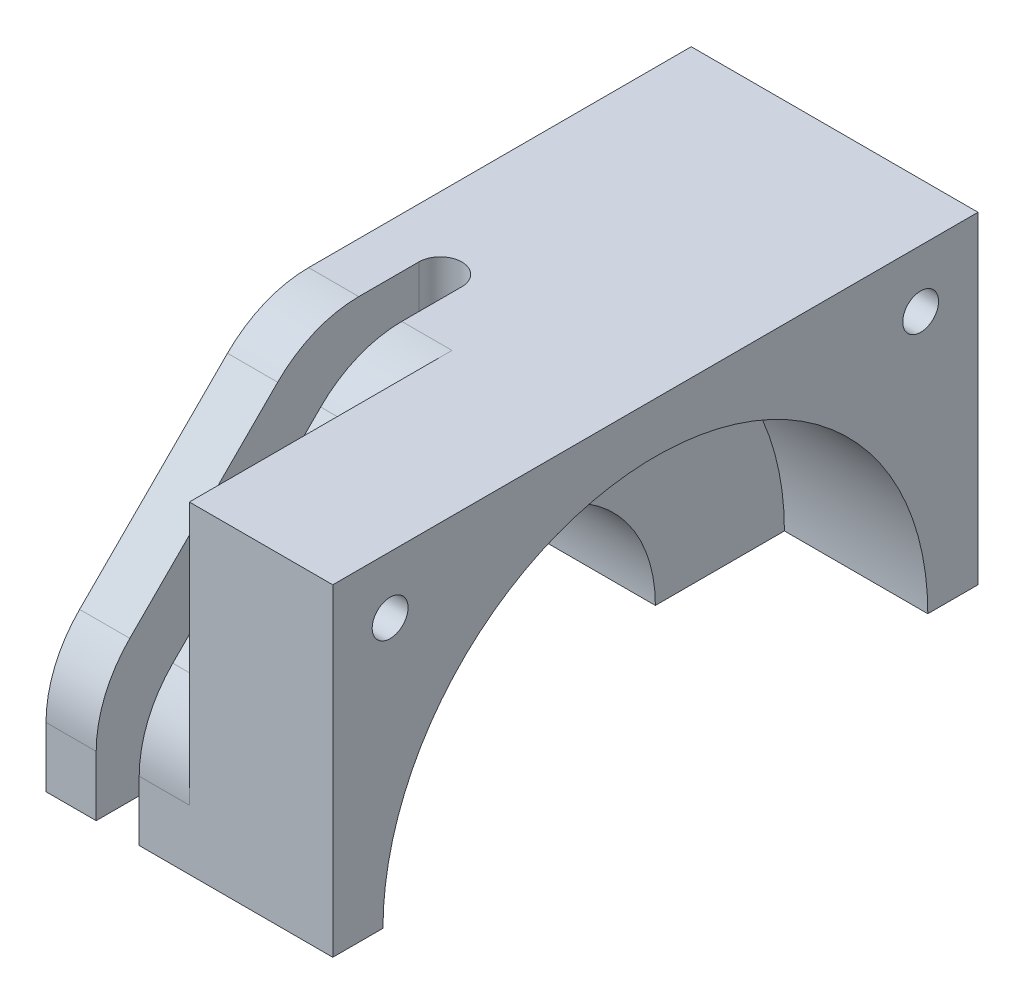
ISO-10303-21;
HEADER;
FILE_DESCRIPTION(('STEP AP214'),'2;1');
FILE_NAME('part.step','',(''),(''),'','','');
FILE_SCHEMA(('AUTOMOTIVE_DESIGN { 1 0 10303 214 1 1 1 1 }'));
ENDSEC;
DATA;
#1=APPLICATION_CONTEXT('core data for automotive mechanical design processes');
#2=APPLICATION_PROTOCOL_DEFINITION('international standard','automotive_design',2000,#1);
#3=PRODUCT_CONTEXT('',#1,'mechanical');
#4=PRODUCT('Part','Part','',(#3));
#5=PRODUCT_RELATED_PRODUCT_CATEGORY('part','',(#4));
#6=PRODUCT_DEFINITION_FORMATION('','',#4);
#7=PRODUCT_DEFINITION_CONTEXT('part definition',#1,'design');
#8=PRODUCT_DEFINITION('design','',#6,#7);
#9=PRODUCT_DEFINITION_SHAPE('','',#8);
#10=(LENGTH_UNIT() NAMED_UNIT(*) SI_UNIT(.MILLI.,.METRE.));
#11=(NAMED_UNIT(*) PLANE_ANGLE_UNIT() SI_UNIT($,.RADIAN.));
#12=(NAMED_UNIT(*) SI_UNIT($,.STERADIAN.) SOLID_ANGLE_UNIT());
#13=UNCERTAINTY_MEASURE_WITH_UNIT(LENGTH_MEASURE(1.E-05),#10,'distance_accuracy_value','');
#14=(GEOMETRIC_REPRESENTATION_CONTEXT(3) GLOBAL_UNCERTAINTY_ASSIGNED_CONTEXT((#13)) GLOBAL_UNIT_ASSIGNED_CONTEXT((#10,
#11,#12)) REPRESENTATION_CONTEXT('',''));
#15=CARTESIAN_POINT('',(0.,0.,0.));
#16=DIRECTION('',(0.,0.,1.));
#17=DIRECTION('',(1.,0.,0.));
#18=AXIS2_PLACEMENT_3D('',#15,#16,#17);
#19=CARTESIAN_POINT('',(27.7245829544828,0.,-34.06));
#20=DIRECTION('',(0.,-1.,0.));
#21=DIRECTION('',(0.,0.,-1.));
#22=AXIS2_PLACEMENT_3D('',#19,#20,#21);
#23=PLANE('',#22);
#24=DIRECTION('',(-1.,0.,0.));
#25=VECTOR('',#24,1.);
#26=CARTESIAN_POINT('',(-53.5619892583636,0.,-22.5));
#27=LINE('',#26,#25);
#28=CARTESIAN_POINT('',(56.05,0.,-22.5));
#29=VERTEX_POINT('',#28);
#30=CARTESIAN_POINT('',(36.05,0.,-22.5));
#31=VERTEX_POINT('',#30);
#32=EDGE_CURVE('E208',#29,#31,#27,.T.);
#33=ORIENTED_EDGE('',*,*,#32,.F.);
#34=DIRECTION('',(0.,0.,-1.));
#35=VECTOR('',#34,1.);
#36=CARTESIAN_POINT('',(56.05,0.,0.));
#37=LINE('',#36,#35);
#38=CARTESIAN_POINT('',(56.05,0.,-19.));
#39=VERTEX_POINT('',#38);
#40=EDGE_CURVE('E387',#39,#29,#37,.T.);
#41=ORIENTED_EDGE('',*,*,#40,.F.);
#42=DIRECTION('',(1.,0.,0.));
#43=VECTOR('',#42,1.);
#44=CARTESIAN_POINT('',(46.05,0.,-19.));
#45=LINE('',#44,#43);
#46=CARTESIAN_POINT('',(46.05,0.,-19.));
#47=VERTEX_POINT('',#46);
#48=EDGE_CURVE('E216',#39,#47,#45,.F.);
#49=ORIENTED_EDGE('',*,*,#48,.T.);
#50=DIRECTION('',(0.,0.,-1.));
#51=VECTOR('',#50,1.);
#52=CARTESIAN_POINT('',(46.05,0.,0.));
#53=LINE('',#52,#51);
#54=CARTESIAN_POINT('',(46.05,0.,-10.));
#55=VERTEX_POINT('',#54);
#56=EDGE_CURVE('E382',#55,#47,#53,.T.);
#57=ORIENTED_EDGE('',*,*,#56,.F.);
#58=DIRECTION('',(1.,0.,0.));
#59=VECTOR('',#58,1.);
#60=CARTESIAN_POINT('',(21.05,0.,-10.));
#61=LINE('',#60,#59);
#62=CARTESIAN_POINT('',(36.05,0.,-10.));
#63=VERTEX_POINT('',#62);
#64=EDGE_CURVE('E405',#55,#63,#61,.F.);
#65=ORIENTED_EDGE('',*,*,#64,.T.);
#66=DIRECTION('',(0.,0.,1.));
#67=VECTOR('',#66,1.);
#68=CARTESIAN_POINT('',(36.05,0.,0.));
#69=LINE('',#68,#67);
#70=EDGE_CURVE('E402',#31,#63,#69,.T.);
#71=ORIENTED_EDGE('',*,*,#70,.F.);
#72=EDGE_LOOP('',(#33,#41,#49,#57,#65,#71));
#73=FACE_BOUND('',#72,.T.);
#74=ADVANCED_FACE('F47',(#73),#23,.T.);
#75=CARTESIAN_POINT('',(36.05,0.,10.));
#76=VERTEX_POINT('',#75);
#77=CARTESIAN_POINT('',(36.05,0.,22.5));
#78=VERTEX_POINT('',#77);
#79=EDGE_CURVE('E401',#76,#78,#69,.T.);
#80=ORIENTED_EDGE('',*,*,#79,.F.);
#81=DIRECTION('',(1.,0.,0.));
#82=VECTOR('',#81,1.);
#83=CARTESIAN_POINT('',(21.05,0.,10.));
#84=LINE('',#83,#82);
#85=CARTESIAN_POINT('',(39.55,0.,10.));
#86=VERTEX_POINT('',#85);
#87=EDGE_CURVE('E213',#76,#86,#84,.T.);
#88=ORIENTED_EDGE('',*,*,#87,.T.);
#89=DIRECTION('',(0.,0.,1.));
#90=VECTOR('',#89,1.);
#91=CARTESIAN_POINT('',(39.55,0.,0.));
#92=LINE('',#91,#90);
#93=CARTESIAN_POINT('',(39.55,0.,22.5));
#94=VERTEX_POINT('',#93);
#95=EDGE_CURVE('E51',#86,#94,#92,.T.);
#96=ORIENTED_EDGE('',*,*,#95,.T.);
#97=DIRECTION('',(1.,0.,0.));
#98=VECTOR('',#97,1.);
#99=CARTESIAN_POINT('',(-53.5619892583636,0.,22.5));
#100=LINE('',#99,#98);
#101=EDGE_CURVE('E201',#78,#94,#100,.T.);
#102=ORIENTED_EDGE('',*,*,#101,.F.);
#103=EDGE_LOOP('',(#80,#88,#96,#102));
#104=FACE_BOUND('',#103,.T.);
#105=ADVANCED_FACE('F211',(#104),#23,.T.);
#106=CARTESIAN_POINT('',(46.05,0.,19.));
#107=VERTEX_POINT('',#106);
#108=CARTESIAN_POINT('',(46.05,0.,10.));
#109=VERTEX_POINT('',#108);
#110=EDGE_CURVE('E380',#107,#109,#53,.T.);
#111=ORIENTED_EDGE('',*,*,#110,.F.);
#112=DIRECTION('',(1.,0.,0.));
#113=VECTOR('',#112,1.);
#114=CARTESIAN_POINT('',(46.05,0.,19.));
#115=LINE('',#114,#113);
#116=CARTESIAN_POINT('',(56.05,0.,19.));
#117=VERTEX_POINT('',#116);
#118=EDGE_CURVE('E214',#107,#117,#115,.T.);
#119=ORIENTED_EDGE('',*,*,#118,.T.);
#120=CARTESIAN_POINT('',(56.05,0.,22.5));
#121=VERTEX_POINT('',#120);
#122=EDGE_CURVE('E392',#121,#117,#37,.T.);
#123=ORIENTED_EDGE('',*,*,#122,.F.);
#124=CARTESIAN_POINT('',(42.55,0.,22.5));
#125=VERTEX_POINT('',#124);
#126=EDGE_CURVE('E207',#125,#121,#100,.T.);
#127=ORIENTED_EDGE('',*,*,#126,.F.);
#128=DIRECTION('',(0.,0.,1.));
#129=VECTOR('',#128,1.);
#130=CARTESIAN_POINT('',(42.55,0.,0.));
#131=LINE('',#130,#129);
#132=CARTESIAN_POINT('',(42.55,0.,10.));
#133=VERTEX_POINT('',#132);
#134=EDGE_CURVE('E270',#133,#125,#131,.T.);
#135=ORIENTED_EDGE('',*,*,#134,.F.);
#136=EDGE_CURVE('E222',#133,#109,#84,.T.);
#137=ORIENTED_EDGE('',*,*,#136,.T.);
#138=EDGE_LOOP('',(#111,#119,#123,#127,#135,#137));
#139=FACE_BOUND('',#138,.T.);
#140=ADVANCED_FACE('F349',(#139),#23,.T.);
#141=CARTESIAN_POINT('',(48.15,18.5,18.5));
#142=DIRECTION('',(1.,0.,0.));
#143=DIRECTION('',(0.,0.,-1.));
#144=AXIS2_PLACEMENT_3D('',#141,#142,#143);
#145=CONICAL_SURFACE('',#144,1.25,1.02974425867665);
#146=CARTESIAN_POINT('',(47.3989242262155,18.5,18.5));
#147=VERTEX_POINT('',#146);
#148=VERTEX_LOOP('',#147);
#149=FACE_BOUND('',#148,.T.);
#150=CARTESIAN_POINT('',(48.15,18.5,18.5));
#151=DIRECTION('',(1.,0.,0.));
#152=DIRECTION('',(0.,0.,-1.));
#153=AXIS2_PLACEMENT_3D('',#150,#151,#152);
#154=CIRCLE('',#153,1.25);
#155=CARTESIAN_POINT('',(48.15,18.5,17.25));
#156=VERTEX_POINT('',#155);
#157=EDGE_CURVE('E11',#156,#156,#154,.T.);
#158=ORIENTED_EDGE('',*,*,#157,.T.);
#159=EDGE_LOOP('',(#158));
#160=FACE_BOUND('',#159,.T.);
#161=ADVANCED_FACE('F346',(#149,#160),#145,.F.);
#162=CARTESIAN_POINT('',(48.15,18.5,-18.5));
#163=DIRECTION('',(1.,0.,0.));
#164=DIRECTION('',(0.,0.,-1.));
#165=AXIS2_PLACEMENT_3D('',#162,#163,#164);
#166=CONICAL_SURFACE('',#165,1.25,1.02974425867665);
#167=CARTESIAN_POINT('',(47.3989242262155,18.5,-18.5));
#168=VERTEX_POINT('',#167);
#169=VERTEX_LOOP('',#168);
#170=FACE_BOUND('',#169,.T.);
#171=CARTESIAN_POINT('',(48.15,18.5,-18.5));
#172=DIRECTION('',(1.,0.,0.));
#173=DIRECTION('',(0.,0.,-1.));
#174=AXIS2_PLACEMENT_3D('',#171,#172,#173);
#175=CIRCLE('',#174,1.25);
#176=CARTESIAN_POINT('',(48.15,18.5,-19.75));
#177=VERTEX_POINT('',#176);
#178=EDGE_CURVE('E284',#177,#177,#175,.T.);
#179=ORIENTED_EDGE('',*,*,#178,.T.);
#180=EDGE_LOOP('',(#179));
#181=FACE_BOUND('',#180,.T.);
#182=ADVANCED_FACE('F348',(#170,#181),#166,.F.);
#183=CARTESIAN_POINT('',(36.05,-17.5,0.));
#184=DIRECTION('',(-1.,0.,0.));
#185=DIRECTION('',(0.,0.,1.));
#186=AXIS2_PLACEMENT_3D('',#183,#184,#185);
#187=PLANE('',#186);
#188=DIRECTION('',(0.,1.,0.));
#189=VECTOR('',#188,1.);
#190=CARTESIAN_POINT('',(36.05,-17.5,-22.5));
#191=LINE('',#190,#189);
#192=CARTESIAN_POINT('',(36.05,22.5,-22.5));
#193=VERTEX_POINT('',#192);
#194=EDGE_CURVE('E247',#31,#193,#191,.T.);
#195=ORIENTED_EDGE('',*,*,#194,.F.);
#196=ORIENTED_EDGE('',*,*,#70,.T.);
#197=CARTESIAN_POINT('',(36.05,0.,0.));
#198=DIRECTION('',(-1.,0.,0.));
#199=DIRECTION('',(0.,0.,1.));
#200=AXIS2_PLACEMENT_3D('',#197,#198,#199);
#201=CIRCLE('',#200,10.);
#202=EDGE_CURVE('E245',#63,#76,#201,.F.);
#203=ORIENTED_EDGE('',*,*,#202,.T.);
#204=ORIENTED_EDGE('',*,*,#79,.T.);
#205=DIRECTION('',(0.,1.,0.));
#206=VECTOR('',#205,1.);
#207=CARTESIAN_POINT('',(36.05,-17.5,22.5));
#208=LINE('',#207,#206);
#209=CARTESIAN_POINT('',(36.05,4.18629150101523,22.5));
#210=VERTEX_POINT('',#209);
#211=EDGE_CURVE('E203',#78,#210,#208,.T.);
#212=ORIENTED_EDGE('',*,*,#211,.T.);
#213=CARTESIAN_POINT('',(36.05,4.18629150101523,14.5));
#214=DIRECTION('',(-1.,0.,0.));
#215=DIRECTION('',(0.,0.,1.));
#216=AXIS2_PLACEMENT_3D('',#213,#214,#215);
#217=CIRCLE('',#216,8.);
#218=CARTESIAN_POINT('',(36.05,9.84314575050761,20.1568542494924));
#219=VERTEX_POINT('',#218);
#220=EDGE_CURVE('E453',#210,#219,#217,.T.);
#221=ORIENTED_EDGE('',*,*,#220,.T.);
#222=DIRECTION('',(0.,-0.707106781186548,0.707106781186547));
#223=VECTOR('',#222,1.);
#224=CARTESIAN_POINT('',(36.05,6.24999999999999,23.75));
#225=LINE('',#224,#223);
#226=CARTESIAN_POINT('',(36.05,20.1568542494924,9.84314575050761));
#227=VERTEX_POINT('',#226);
#228=EDGE_CURVE('E435',#219,#227,#225,.F.);
#229=ORIENTED_EDGE('',*,*,#228,.T.);
#230=CARTESIAN_POINT('',(36.05,14.5,4.18629150101523));
#231=DIRECTION('',(-1.,0.,0.));
#232=DIRECTION('',(0.,0.,1.));
#233=AXIS2_PLACEMENT_3D('',#230,#231,#232);
#234=CIRCLE('',#233,8.);
#235=CARTESIAN_POINT('',(36.05,22.5,4.18629150101523));
#236=VERTEX_POINT('',#235);
#237=EDGE_CURVE('E411',#227,#236,#234,.T.);
#238=ORIENTED_EDGE('',*,*,#237,.T.);
#239=DIRECTION('',(0.,0.,1.));
#240=VECTOR('',#239,1.);
#241=CARTESIAN_POINT('',(36.05,22.5,0.));
#242=LINE('',#241,#240);
#243=EDGE_CURVE('E248',#193,#236,#242,.T.);
#244=ORIENTED_EDGE('',*,*,#243,.F.);
#245=EDGE_LOOP('',(#195,#196,#203,#204,#212,#221,#229,#238,#244));
#246=FACE_BOUND('',#245,.T.);
#247=ADVANCED_FACE('F313',(#246),#187,.T.);
#248=CARTESIAN_POINT('',(46.05,7.5,7.5));
#249=DIRECTION('',(-1.,0.,0.));
#250=DIRECTION('',(0.,0.,1.));
#251=AXIS2_PLACEMENT_3D('',#248,#249,#250);
#252=PLANE('',#251);
#253=DIRECTION('',(0.,-1.,0.));
#254=VECTOR('',#253,1.);
#255=CARTESIAN_POINT('',(46.05,22.5,22.5));
#256=LINE('',#255,#254);
#257=CARTESIAN_POINT('',(46.05,22.5,22.5));
#258=VERTEX_POINT('',#257);
#259=CARTESIAN_POINT('',(46.05,4.18629150101523,22.5));
#260=VERTEX_POINT('',#259);
#261=EDGE_CURVE('E426',#258,#260,#256,.T.);
#262=ORIENTED_EDGE('',*,*,#261,.F.);
#263=DIRECTION('',(0.,0.,1.));
#264=VECTOR('',#263,1.);
#265=CARTESIAN_POINT('',(46.05,22.5,0.));
#266=LINE('',#265,#264);
#267=CARTESIAN_POINT('',(46.05,22.5,4.18629150101523));
#268=VERTEX_POINT('',#267);
#269=EDGE_CURVE('E424',#268,#258,#266,.T.);
#270=ORIENTED_EDGE('',*,*,#269,.F.);
#271=CARTESIAN_POINT('',(46.05,14.5,4.18629150101523));
#272=DIRECTION('',(-1.,0.,0.));
#273=DIRECTION('',(0.,0.,1.));
#274=AXIS2_PLACEMENT_3D('',#271,#272,#273);
#275=CIRCLE('',#274,8.);
#276=CARTESIAN_POINT('',(46.05,20.1568542494924,9.84314575050761));
#277=VERTEX_POINT('',#276);
#278=EDGE_CURVE('E470',#268,#277,#275,.F.);
#279=ORIENTED_EDGE('',*,*,#278,.T.);
#280=DIRECTION('',(0.,-0.707106781186548,0.707106781186547));
#281=VECTOR('',#280,1.);
#282=CARTESIAN_POINT('',(46.05,22.5,7.5));
#283=LINE('',#282,#281);
#284=CARTESIAN_POINT('',(46.05,9.84314575050761,20.1568542494924));
#285=VERTEX_POINT('',#284);
#286=EDGE_CURVE('E283',#285,#277,#283,.F.);
#287=ORIENTED_EDGE('',*,*,#286,.F.);
#288=CARTESIAN_POINT('',(46.05,4.18629150101523,14.5));
#289=DIRECTION('',(-1.,0.,0.));
#290=DIRECTION('',(0.,0.,1.));
#291=AXIS2_PLACEMENT_3D('',#288,#289,#290);
#292=CIRCLE('',#291,8.);
#293=EDGE_CURVE('E467',#285,#260,#292,.F.);
#294=ORIENTED_EDGE('',*,*,#293,.T.);
#295=EDGE_LOOP('',(#262,#270,#279,#287,#294));
#296=FACE_BOUND('',#295,.T.);
#297=ADVANCED_FACE('F309',(#296),#252,.T.);
#298=CARTESIAN_POINT('',(-53.5619892583636,22.5,-22.5));
#299=DIRECTION('',(0.,0.,-1.));
#300=DIRECTION('',(0.,1.,0.));
#301=AXIS2_PLACEMENT_3D('',#298,#299,#300);
#302=PLANE('',#301);
#303=DIRECTION('',(0.,1.,0.));
#304=VECTOR('',#303,1.);
#305=CARTESIAN_POINT('',(56.05,22.5,-22.5));
#306=LINE('',#305,#304);
#307=CARTESIAN_POINT('',(56.05,22.5,-22.5));
#308=VERTEX_POINT('',#307);
#309=EDGE_CURVE('E233',#29,#308,#306,.T.);
#310=ORIENTED_EDGE('',*,*,#309,.F.);
#311=ORIENTED_EDGE('',*,*,#32,.T.);
#312=ORIENTED_EDGE('',*,*,#194,.T.);
#313=DIRECTION('',(1.,0.,0.));
#314=VECTOR('',#313,1.);
#315=CARTESIAN_POINT('',(-53.5619892583636,22.5,-22.5));
#316=LINE('',#315,#314);
#317=EDGE_CURVE('E228',#193,#308,#316,.T.);
#318=ORIENTED_EDGE('',*,*,#317,.T.);
#319=EDGE_LOOP('',(#310,#311,#312,#318));
#320=FACE_BOUND('',#319,.T.);
#321=ADVANCED_FACE('F312',(#320),#302,.T.);
#322=CARTESIAN_POINT('',(63.15,18.5,18.5));
#323=DIRECTION('',(1.,0.,0.));
#324=DIRECTION('',(0.,0.,-1.));
#325=AXIS2_PLACEMENT_3D('',#322,#323,#324);
#326=CYLINDRICAL_SURFACE('',#325,1.24999999999999);
#327=CARTESIAN_POINT('',(56.05,18.5,18.5));
#328=DIRECTION('',(1.,0.,0.));
#329=DIRECTION('',(0.,0.,-1.));
#330=AXIS2_PLACEMENT_3D('',#327,#328,#329);
#331=CIRCLE('',#330,1.24999999999999);
#332=CARTESIAN_POINT('',(56.05,18.5,17.25));
#333=VERTEX_POINT('',#332);
#334=EDGE_CURVE('E56',#333,#333,#331,.T.);
#335=ORIENTED_EDGE('',*,*,#334,.T.);
#336=EDGE_LOOP('',(#335));
#337=FACE_BOUND('',#336,.T.);
#338=ORIENTED_EDGE('',*,*,#157,.F.);
#339=EDGE_LOOP('',(#338));
#340=FACE_BOUND('',#339,.T.);
#341=ADVANCED_FACE('F342',(#337,#340),#326,.F.);
#342=CARTESIAN_POINT('',(63.15,18.5,-18.5));
#343=DIRECTION('',(1.,0.,0.));
#344=DIRECTION('',(0.,0.,-1.));
#345=AXIS2_PLACEMENT_3D('',#342,#343,#344);
#346=CYLINDRICAL_SURFACE('',#345,1.24999999999999);
#347=CARTESIAN_POINT('',(56.05,18.5,-18.5));
#348=DIRECTION('',(1.,0.,0.));
#349=DIRECTION('',(0.,0.,-1.));
#350=AXIS2_PLACEMENT_3D('',#347,#348,#349);
#351=CIRCLE('',#350,1.24999999999999);
#352=CARTESIAN_POINT('',(56.05,18.5,-19.75));
#353=VERTEX_POINT('',#352);
#354=EDGE_CURVE('E440',#353,#353,#351,.T.);
#355=ORIENTED_EDGE('',*,*,#354,.T.);
#356=EDGE_LOOP('',(#355));
#357=FACE_BOUND('',#356,.T.);
#358=ORIENTED_EDGE('',*,*,#178,.F.);
#359=EDGE_LOOP('',(#358));
#360=FACE_BOUND('',#359,.T.);
#361=ADVANCED_FACE('F334',(#357,#360),#346,.F.);
#362=CARTESIAN_POINT('',(0.,14.5,4.18629150101523));
#363=DIRECTION('',(-1.,0.,0.));
#364=DIRECTION('',(0.,0.,1.));
#365=AXIS2_PLACEMENT_3D('',#362,#363,#364);
#366=CYLINDRICAL_SURFACE('',#365,8.);
#367=ORIENTED_EDGE('',*,*,#237,.F.);
#368=DIRECTION('',(1.,0.,0.));
#369=VECTOR('',#368,1.);
#370=CARTESIAN_POINT('',(0.,20.1568542494924,9.84314575050761));
#371=LINE('',#370,#369);
#372=CARTESIAN_POINT('',(39.55,20.1568542494924,9.84314575050761));
#373=VERTEX_POINT('',#372);
#374=EDGE_CURVE('E455',#373,#227,#371,.F.);
#375=ORIENTED_EDGE('',*,*,#374,.F.);
#376=CARTESIAN_POINT('',(39.55,14.5,4.18629150101523));
#377=DIRECTION('',(1.,0.,0.));
#378=DIRECTION('',(0.,0.,-1.));
#379=AXIS2_PLACEMENT_3D('',#376,#377,#378);
#380=CIRCLE('',#379,8.);
#381=CARTESIAN_POINT('',(39.55,22.5,4.18629150101523));
#382=VERTEX_POINT('',#381);
#383=EDGE_CURVE('E459',#382,#373,#380,.T.);
#384=ORIENTED_EDGE('',*,*,#383,.F.);
#385=DIRECTION('',(-1.,0.,0.));
#386=VECTOR('',#385,1.);
#387=CARTESIAN_POINT('',(0.,22.5,4.18629150101523));
#388=LINE('',#387,#386);
#389=EDGE_CURVE('E462',#236,#382,#388,.F.);
#390=ORIENTED_EDGE('',*,*,#389,.F.);
#391=EDGE_LOOP('',(#367,#375,#384,#390));
#392=FACE_BOUND('',#391,.T.);
#393=ADVANCED_FACE('F331',(#392),#366,.T.);
#394=CARTESIAN_POINT('',(21.05,0.,0.));
#395=DIRECTION('',(1.,0.,0.));
#396=DIRECTION('',(0.,0.,-1.));
#397=AXIS2_PLACEMENT_3D('',#394,#395,#396);
#398=CYLINDRICAL_SURFACE('',#397,10.);
#399=ORIENTED_EDGE('',*,*,#64,.F.);
#400=CARTESIAN_POINT('',(46.05,0.,0.));
#401=DIRECTION('',(1.,0.,0.));
#402=DIRECTION('',(0.,0.,-1.));
#403=AXIS2_PLACEMENT_3D('',#400,#401,#402);
#404=CIRCLE('',#403,10.);
#405=EDGE_CURVE('E238',#109,#55,#404,.F.);
#406=ORIENTED_EDGE('',*,*,#405,.F.);
#407=ORIENTED_EDGE('',*,*,#136,.F.);
#408=CARTESIAN_POINT('',(42.55,0.,0.));
#409=DIRECTION('',(1.,0.,0.));
#410=DIRECTION('',(0.,0.,-1.));
#411=AXIS2_PLACEMENT_3D('',#408,#409,#410);
#412=CIRCLE('',#411,10.);
#413=CARTESIAN_POINT('',(42.55,10.,0.));
#414=VERTEX_POINT('',#413);
#415=EDGE_CURVE('E422',#133,#414,#412,.F.);
#416=ORIENTED_EDGE('',*,*,#415,.T.);
#417=CARTESIAN_POINT('',(41.05,9.88685996664259,-1.5));
#418=CARTESIAN_POINT('',(40.96625443071,9.88686136668593,-1.49999654107284));
#419=CARTESIAN_POINT('',(40.8824602492493,9.88793551739101,-1.49296296388491));
#420=CARTESIAN_POINT('',(40.7172146851169,9.8921131480324,-1.46502196657001));
#421=CARTESIAN_POINT('',(40.63576566852,9.8952186073143,-1.44410101402628));
#422=CARTESIAN_POINT('',(40.4776262445531,9.90309938986228,-1.38902526098084));
#423=CARTESIAN_POINT('',(40.4009322374578,9.90787343131536,-1.35488061681397));
#424=CARTESIAN_POINT('',(40.2543729692279,9.91855194113145,-1.27435063087792));
#425=CARTESIAN_POINT('',(40.1845067697857,9.92445625383668,-1.22796697429872));
#426=CARTESIAN_POINT('',(40.0530161832457,9.93678289248039,-1.12387902418559));
#427=CARTESIAN_POINT('',(39.9914543865933,9.94320862458057,-1.06609605584821));
#428=CARTESIAN_POINT('',(39.8788625143445,9.95582368169047,-0.941019605444381));
#429=CARTESIAN_POINT('',(39.827833017833,9.96201299368615,-0.873725600786537));
#430=CARTESIAN_POINT('',(39.7375233683086,9.97349347428185,-0.731136358052753));
#431=CARTESIAN_POINT('',(39.6983008496775,9.97878018435569,-0.655804227365774));
#432=CARTESIAN_POINT('',(39.6330884011918,9.98782206746405,-0.499528850106981));
#433=CARTESIAN_POINT('',(39.6070977721571,9.99157732141944,-0.418585900270685));
#434=CARTESIAN_POINT('',(39.5692766114692,9.99710914797782,-0.254031123090578));
#435=CARTESIAN_POINT('',(39.5573412736128,9.99890035887344,-0.170443884389875));
#436=CARTESIAN_POINT('',(39.5476440651751,10.0003524476958,-0.00243520401948773));
#437=CARTESIAN_POINT('',(39.5498814066803,10.0000134440494,0.0819861910157378));
#438=CARTESIAN_POINT('',(39.5683833377624,9.99725499660796,0.248551718200511));
#439=CARTESIAN_POINT('',(39.5845351717915,9.99485227652479,0.330708691399998));
#440=CARTESIAN_POINT('',(39.6302306063226,9.98825500227851,0.491132829143127));
#441=CARTESIAN_POINT('',(39.6597745515014,9.98406040199739,0.569399893513472));
#442=CARTESIAN_POINT('',(39.7315309969171,9.97432193873206,0.720163780770307));
#443=CARTESIAN_POINT('',(39.7737909651087,9.96877303515638,0.792637672323586));
#444=CARTESIAN_POINT('',(39.86974519367,9.95694438245421,0.929507907150167));
#445=CARTESIAN_POINT('',(39.9234402067069,9.95066458523184,0.993903718271726));
#446=CARTESIAN_POINT('',(40.0413684488266,9.93800158192626,1.11345448272264));
#447=CARTESIAN_POINT('',(40.1057001219701,9.93161796623256,1.16851232950946));
#448=CARTESIAN_POINT('',(40.2427410771237,9.91952704453523,1.26706599338812));
#449=CARTESIAN_POINT('',(40.3154504107199,9.91381974269649,1.31056173927998));
#450=CARTESIAN_POINT('',(40.4672839629406,9.90372775286856,1.38476964534604));
#451=CARTESIAN_POINT('',(40.5464131336624,9.89934409845291,1.41547182270081));
#452=CARTESIAN_POINT('',(40.7087852551474,9.89241402899059,1.46312336208878));
#453=CARTESIAN_POINT('',(40.7920279155467,9.88986748446299,1.48007369337325));
#454=CARTESIAN_POINT('',(40.9594000895775,9.88692451395027,1.49960720086654));
#455=CARTESIAN_POINT('',(41.0435131882015,9.88650748802574,1.50232803265051));
#456=CARTESIAN_POINT('',(41.2109941948173,9.88781607937153,1.49369057019818));
#457=CARTESIAN_POINT('',(41.2943621258508,9.88954163015778,1.48233271282301));
#458=CARTESIAN_POINT('',(41.4575598179656,9.89492202461453,1.44597702952765));
#459=CARTESIAN_POINT('',(41.5374052049416,9.89856716482858,1.4210477852782));
#460=CARTESIAN_POINT('',(41.6917840920486,9.90736801825768,1.35832831947086));
#461=CARTESIAN_POINT('',(41.7663173296282,9.91252380607176,1.32053746276388));
#462=CARTESIAN_POINT('',(41.908573260335,9.92381355687063,1.23283677995322));
#463=CARTESIAN_POINT('',(41.9762404472798,9.92995459279988,1.18283784561765));
#464=CARTESIAN_POINT('',(42.1022728598738,9.94250159433355,1.072264168372));
#465=CARTESIAN_POINT('',(42.1606375591811,9.94890757490292,1.01168882744679));
#466=CARTESIAN_POINT('',(42.2669026066336,9.96132705217386,0.881075619628177));
#467=CARTESIAN_POINT('',(42.3147117282425,9.96733683460423,0.810963126771949));
#468=CARTESIAN_POINT('',(42.3978729052626,9.97822905032016,0.663622080263672));
#469=CARTESIAN_POINT('',(42.433225301465,9.98311151444563,0.586393721360432));
#470=CARTESIAN_POINT('',(42.490323742488,9.99118269660795,0.427297995861142));
#471=CARTESIAN_POINT('',(42.5121196670784,9.99437761717899,0.345448858754297));
#472=CARTESIAN_POINT('',(42.5416478795375,9.99873976656896,0.179200815501188));
#473=CARTESIAN_POINT('',(42.5493810962491,9.99990712930801,0.094802078130576));
#474=CARTESIAN_POINT('',(42.5505417045494,10.0000812905914,-0.0732645908608229));
#475=CARTESIAN_POINT('',(42.544108680877,9.99910917023796,-0.156931570212056));
#476=CARTESIAN_POINT('',(42.5174186115792,9.99515610519141,-0.321979795323111));
#477=CARTESIAN_POINT('',(42.4971616101914,9.99217516692666,-0.403361048396517));
#478=CARTESIAN_POINT('',(42.4434481244297,9.98453786742463,-0.561489374379665));
#479=CARTESIAN_POINT('',(42.410001304861,9.97988273316947,-0.638239793148787));
#480=CARTESIAN_POINT('',(42.3308725120168,9.96940834495499,-0.785061117896607));
#481=CARTESIAN_POINT('',(42.2851901415196,9.96358905320338,-0.855131806920714));
#482=CARTESIAN_POINT('',(42.1823823011708,9.95136510636178,-0.987312585191965));
#483=CARTESIAN_POINT('',(42.1251537741836,9.94495548425941,-1.04934206644639));
#484=CARTESIAN_POINT('',(42.0010949269195,9.93231001689001,-1.16296808390268));
#485=CARTESIAN_POINT('',(41.9342623561756,9.92607421276291,-1.21456216798984));
#486=CARTESIAN_POINT('',(41.7924510167675,9.91444484029116,-1.30611310822975));
#487=CARTESIAN_POINT('',(41.7174285829782,9.90905620156985,-1.34600294291209));
#488=CARTESIAN_POINT('',(41.5617032232367,9.89978909110724,-1.41255613872045));
#489=CARTESIAN_POINT('',(41.4810062921422,9.89590905307931,-1.43923322574898));
#490=CARTESIAN_POINT('',(41.3416225637435,9.89099485524825,-1.47254951890027));
#491=CARTESIAN_POINT('',(41.2837966030757,9.88945249382379,-1.4828276978042));
#492=CARTESIAN_POINT('',(41.1673217082656,9.88738456567011,-1.49655410576574));
#493=CARTESIAN_POINT('',(41.1086727848004,9.88685898576155,-1.50000242335076));
#494=CARTESIAN_POINT('',(41.05,9.88685996664259,-1.5));
#495=B_SPLINE_CURVE_WITH_KNOTS('',3,(#417,#418,#419,#420,#421,#422,#423,#424,#425,#426,#427,
#428,#429,#430,#431,#432,#433,#434,#435,#436,#437,#438,#439,#440,#441,#442,#443,#444,#445,#446,
#447,#448,#449,#450,#451,#452,#453,#454,#455,#456,#457,#458,#459,#460,#461,#462,#463,#464,#465,
#466,#467,#468,#469,#470,#471,#472,#473,#474,#475,#476,#477,#478,#479,#480,#481,#482,#483,#484,
#485,#486,#487,#488,#489,#490,#491,#492,#493,#494),.UNSPECIFIED.,.T.,.F.,(4,2,2,2,2,2,2,2,2,2,2,
2,2,2,2,2,2,2,2,2,2,2,2,2,2,2,2,2,2,2,2,2,2,2,2,2,2,2,4),(0.,0.251022251804869,0.5022894695618,
0.753364085335677,1.00440414866132,1.25724158649107,1.51009292207817,1.76415922105782,
2.018212093645,2.27035832534396,2.52249053939373,2.77259862515727,3.02271314839401,
3.27377316386452,3.52484970949271,3.77839544666268,4.03194274514349,4.28568751773138,
4.53941440444339,4.79068214603743,5.04194209099917,5.29194394807373,5.54195815286116,
5.79385486001301,6.045765814618,6.29977537753514,6.55377799071853,6.80684040891088,
7.05988611170471,7.31044963622325,7.56101235892821,7.81139182257831,8.06177941567105,
8.31450950010968,8.56729890236861,8.8215087882493,9.07545403445561,9.2513244189161,
9.4271925237619),.UNSPECIFIED.);
#496=CARTESIAN_POINT('',(39.55,10.,0.));
#497=VERTEX_POINT('',#496);
#498=EDGE_CURVE('E275',#414,#497,#495,.T.);
#499=ORIENTED_EDGE('',*,*,#498,.T.);
#500=CARTESIAN_POINT('',(39.55,0.,0.));
#501=DIRECTION('',(1.,0.,0.));
#502=DIRECTION('',(0.,0.,-1.));
#503=AXIS2_PLACEMENT_3D('',#500,#501,#502);
#504=CIRCLE('',#503,10.);
#505=EDGE_CURVE('E229',#86,#497,#504,.F.);
#506=ORIENTED_EDGE('',*,*,#505,.F.);
#507=ORIENTED_EDGE('',*,*,#87,.F.);
#508=ORIENTED_EDGE('',*,*,#202,.F.);
#509=EDGE_LOOP('',(#399,#406,#407,#416,#499,#506,#507,#508));
#510=FACE_BOUND('',#509,.T.);
#511=ADVANCED_FACE('F333',(#510),#398,.F.);
#512=CARTESIAN_POINT('',(41.05,22.5,0.));
#513=DIRECTION('',(0.,-1.,0.));
#514=DIRECTION('',(0.,0.,-1.));
#515=AXIS2_PLACEMENT_3D('',#512,#513,#514);
#516=CYLINDRICAL_SURFACE('',#515,1.5);
#517=DIRECTION('',(0.,-1.,0.));
#518=VECTOR('',#517,1.);
#519=CARTESIAN_POINT('',(42.55,0.,0.));
#520=LINE('',#519,#518);
#521=CARTESIAN_POINT('',(42.55,22.5,0.));
#522=VERTEX_POINT('',#521);
#523=EDGE_CURVE('E264',#522,#414,#520,.T.);
#524=ORIENTED_EDGE('',*,*,#523,.F.);
#525=CARTESIAN_POINT('',(41.05,22.5,0.));
#526=DIRECTION('',(0.,1.,0.));
#527=DIRECTION('',(0.,0.,1.));
#528=AXIS2_PLACEMENT_3D('',#525,#526,#527);
#529=CIRCLE('',#528,1.5);
#530=CARTESIAN_POINT('',(39.55,22.5,0.));
#531=VERTEX_POINT('',#530);
#532=EDGE_CURVE('E266',#522,#531,#529,.T.);
#533=ORIENTED_EDGE('',*,*,#532,.T.);
#534=DIRECTION('',(0.,-1.,0.));
#535=VECTOR('',#534,1.);
#536=CARTESIAN_POINT('',(39.55,0.,0.));
#537=LINE('',#536,#535);
#538=EDGE_CURVE('E197',#531,#497,#537,.T.);
#539=ORIENTED_EDGE('',*,*,#538,.T.);
#540=ORIENTED_EDGE('',*,*,#498,.F.);
#541=EDGE_LOOP('',(#524,#533,#539,#540));
#542=FACE_BOUND('',#541,.T.);
#543=ADVANCED_FACE('F285',(#542),#516,.F.);
#544=CARTESIAN_POINT('',(0.,22.5,0.));
#545=DIRECTION('',(0.,1.,0.));
#546=DIRECTION('',(0.,0.,1.));
#547=AXIS2_PLACEMENT_3D('',#544,#545,#546);
#548=PLANE('',#547);
#549=DIRECTION('',(0.,0.,-1.));
#550=VECTOR('',#549,1.);
#551=CARTESIAN_POINT('',(42.55,22.5,0.));
#552=LINE('',#551,#550);
#553=CARTESIAN_POINT('',(42.55,22.5,4.18629150101523));
#554=VERTEX_POINT('',#553);
#555=EDGE_CURVE('E253',#554,#522,#552,.T.);
#556=ORIENTED_EDGE('',*,*,#555,.F.);
#557=DIRECTION('',(-1.,0.,0.));
#558=VECTOR('',#557,1.);
#559=CARTESIAN_POINT('',(0.,22.5,4.18629150101523));
#560=LINE('',#559,#558);
#561=EDGE_CURVE('E464',#554,#268,#560,.F.);
#562=ORIENTED_EDGE('',*,*,#561,.T.);
#563=ORIENTED_EDGE('',*,*,#269,.T.);
#564=DIRECTION('',(1.,0.,0.));
#565=VECTOR('',#564,1.);
#566=CARTESIAN_POINT('',(-53.5619892583636,22.5,22.5));
#567=LINE('',#566,#565);
#568=CARTESIAN_POINT('',(56.05,22.5,22.5));
#569=VERTEX_POINT('',#568);
#570=EDGE_CURVE('E226',#258,#569,#567,.T.);
#571=ORIENTED_EDGE('',*,*,#570,.T.);
#572=DIRECTION('',(0.,0.,1.));
#573=VECTOR('',#572,1.);
#574=CARTESIAN_POINT('',(56.05,22.5,22.5));
#575=LINE('',#574,#573);
#576=EDGE_CURVE('E232',#308,#569,#575,.T.);
#577=ORIENTED_EDGE('',*,*,#576,.F.);
#578=ORIENTED_EDGE('',*,*,#317,.F.);
#579=ORIENTED_EDGE('',*,*,#243,.T.);
#580=ORIENTED_EDGE('',*,*,#389,.T.);
#581=DIRECTION('',(0.,0.,-1.));
#582=VECTOR('',#581,1.);
#583=CARTESIAN_POINT('',(39.55,22.5,0.));
#584=LINE('',#583,#582);
#585=EDGE_CURVE('E198',#382,#531,#584,.T.);
#586=ORIENTED_EDGE('',*,*,#585,.T.);
#587=ORIENTED_EDGE('',*,*,#532,.F.);
#588=EDGE_LOOP('',(#556,#562,#563,#571,#577,#578,#579,#580,#586,#587));
#589=FACE_BOUND('',#588,.T.);
#590=ADVANCED_FACE('F329',(#589),#548,.T.);
#591=CARTESIAN_POINT('',(0.,14.5,4.18629150101523));
#592=DIRECTION('',(-1.,0.,0.));
#593=DIRECTION('',(0.,0.,1.));
#594=AXIS2_PLACEMENT_3D('',#591,#592,#593);
#595=CYLINDRICAL_SURFACE('',#594,8.);
#596=CARTESIAN_POINT('',(42.55,14.5,4.18629150101523));
#597=DIRECTION('',(1.,0.,0.));
#598=DIRECTION('',(0.,0.,-1.));
#599=AXIS2_PLACEMENT_3D('',#596,#597,#598);
#600=CIRCLE('',#599,8.);
#601=CARTESIAN_POINT('',(42.55,20.1568542494924,9.84314575050761));
#602=VERTEX_POINT('',#601);
#603=EDGE_CURVE('E444',#602,#554,#600,.F.);
#604=ORIENTED_EDGE('',*,*,#603,.F.);
#605=DIRECTION('',(1.,0.,0.));
#606=VECTOR('',#605,1.);
#607=CARTESIAN_POINT('',(0.,20.1568542494924,9.84314575050761));
#608=LINE('',#607,#606);
#609=EDGE_CURVE('E448',#277,#602,#608,.F.);
#610=ORIENTED_EDGE('',*,*,#609,.F.);
#611=ORIENTED_EDGE('',*,*,#278,.F.);
#612=ORIENTED_EDGE('',*,*,#561,.F.);
#613=EDGE_LOOP('',(#604,#610,#611,#612));
#614=FACE_BOUND('',#613,.T.);
#615=ADVANCED_FACE('F307',(#614),#595,.T.);
#616=CARTESIAN_POINT('',(0.,22.5,7.49999999999999));
#617=DIRECTION('',(0.,-0.707106781186547,-0.707106781186548));
#618=DIRECTION('',(1.,0.,0.));
#619=AXIS2_PLACEMENT_3D('',#616,#617,#618);
#620=PLANE('',#619);
#621=DIRECTION('',(0.,-0.707106781186548,0.707106781186547));
#622=VECTOR('',#621,1.);
#623=CARTESIAN_POINT('',(42.55,22.5,7.49999999999999));
#624=LINE('',#623,#622);
#625=CARTESIAN_POINT('',(42.55,9.84314575050761,20.1568542494924));
#626=VERTEX_POINT('',#625);
#627=EDGE_CURVE('E430',#626,#602,#624,.F.);
#628=ORIENTED_EDGE('',*,*,#627,.F.);
#629=DIRECTION('',(-1.,0.,0.));
#630=VECTOR('',#629,1.);
#631=CARTESIAN_POINT('',(0.,9.84314575050761,20.1568542494924));
#632=LINE('',#631,#630);
#633=EDGE_CURVE('E450',#626,#285,#632,.F.);
#634=ORIENTED_EDGE('',*,*,#633,.T.);
#635=ORIENTED_EDGE('',*,*,#286,.T.);
#636=ORIENTED_EDGE('',*,*,#609,.T.);
#637=EDGE_LOOP('',(#628,#634,#635,#636));
#638=FACE_BOUND('',#637,.T.);
#639=ADVANCED_FACE('F300',(#638),#620,.F.);
#640=CARTESIAN_POINT('',(-53.5619892583636,4.18629150101523,14.5));
#641=DIRECTION('',(1.,0.,0.));
#642=DIRECTION('',(0.,0.,-1.));
#643=AXIS2_PLACEMENT_3D('',#640,#641,#642);
#644=CYLINDRICAL_SURFACE('',#643,8.);
#645=ORIENTED_EDGE('',*,*,#293,.F.);
#646=ORIENTED_EDGE('',*,*,#633,.F.);
#647=CARTESIAN_POINT('',(42.55,4.18629150101523,14.5));
#648=DIRECTION('',(1.,0.,0.));
#649=DIRECTION('',(0.,0.,-1.));
#650=AXIS2_PLACEMENT_3D('',#647,#648,#649);
#651=CIRCLE('',#650,8.);
#652=CARTESIAN_POINT('',(42.55,4.18629150101523,22.5));
#653=VERTEX_POINT('',#652);
#654=EDGE_CURVE('E446',#653,#626,#651,.F.);
#655=ORIENTED_EDGE('',*,*,#654,.F.);
#656=DIRECTION('',(1.,0.,0.));
#657=VECTOR('',#656,1.);
#658=CARTESIAN_POINT('',(-53.5619892583636,4.18629150101523,22.5));
#659=LINE('',#658,#657);
#660=EDGE_CURVE('E442',#260,#653,#659,.F.);
#661=ORIENTED_EDGE('',*,*,#660,.F.);
#662=EDGE_LOOP('',(#645,#646,#655,#661));
#663=FACE_BOUND('',#662,.T.);
#664=ADVANCED_FACE('F306',(#663),#644,.T.);
#665=CARTESIAN_POINT('',(-53.5619892583636,22.5,22.5));
#666=DIRECTION('',(0.,0.,1.));
#667=DIRECTION('',(0.,-1.,0.));
#668=AXIS2_PLACEMENT_3D('',#665,#666,#667);
#669=PLANE('',#668);
#670=DIRECTION('',(0.,1.,0.));
#671=VECTOR('',#670,1.);
#672=CARTESIAN_POINT('',(42.55,0.,22.5));
#673=LINE('',#672,#671);
#674=EDGE_CURVE('E259',#125,#653,#673,.T.);
#675=ORIENTED_EDGE('',*,*,#674,.F.);
#676=ORIENTED_EDGE('',*,*,#126,.T.);
#677=DIRECTION('',(0.,-1.,0.));
#678=VECTOR('',#677,1.);
#679=CARTESIAN_POINT('',(56.05,22.5,22.5));
#680=LINE('',#679,#678);
#681=EDGE_CURVE('E235',#569,#121,#680,.T.);
#682=ORIENTED_EDGE('',*,*,#681,.F.);
#683=ORIENTED_EDGE('',*,*,#570,.F.);
#684=ORIENTED_EDGE('',*,*,#261,.T.);
#685=ORIENTED_EDGE('',*,*,#660,.T.);
#686=EDGE_LOOP('',(#675,#676,#682,#683,#684,#685));
#687=FACE_BOUND('',#686,.T.);
#688=ADVANCED_FACE('F293',(#687),#669,.T.);
#689=CARTESIAN_POINT('',(42.55,0.,0.));
#690=DIRECTION('',(1.,0.,0.));
#691=DIRECTION('',(0.,0.,-1.));
#692=AXIS2_PLACEMENT_3D('',#689,#690,#691);
#693=PLANE('',#692);
#694=ORIENTED_EDGE('',*,*,#674,.T.);
#695=ORIENTED_EDGE('',*,*,#654,.T.);
#696=ORIENTED_EDGE('',*,*,#627,.T.);
#697=ORIENTED_EDGE('',*,*,#603,.T.);
#698=ORIENTED_EDGE('',*,*,#555,.T.);
#699=ORIENTED_EDGE('',*,*,#523,.T.);
#700=ORIENTED_EDGE('',*,*,#415,.F.);
#701=ORIENTED_EDGE('',*,*,#134,.T.);
#702=EDGE_LOOP('',(#694,#695,#696,#697,#698,#699,#700,#701));
#703=FACE_BOUND('',#702,.T.);
#704=ADVANCED_FACE('F290',(#703),#693,.F.);
#705=ORIENTED_EDGE('',*,*,#211,.F.);
#706=ORIENTED_EDGE('',*,*,#101,.T.);
#707=DIRECTION('',(0.,1.,0.));
#708=VECTOR('',#707,1.);
#709=CARTESIAN_POINT('',(39.55,0.,22.5));
#710=LINE('',#709,#708);
#711=CARTESIAN_POINT('',(39.55,4.18629150101523,22.5));
#712=VERTEX_POINT('',#711);
#713=EDGE_CURVE('E186',#94,#712,#710,.T.);
#714=ORIENTED_EDGE('',*,*,#713,.T.);
#715=DIRECTION('',(1.,0.,0.));
#716=VECTOR('',#715,1.);
#717=CARTESIAN_POINT('',(-53.5619892583636,4.18629150101523,22.5));
#718=LINE('',#717,#716);
#719=EDGE_CURVE('E437',#712,#210,#718,.F.);
#720=ORIENTED_EDGE('',*,*,#719,.T.);
#721=EDGE_LOOP('',(#705,#706,#714,#720));
#722=FACE_BOUND('',#721,.T.);
#723=ADVANCED_FACE('F202',(#722),#669,.T.);
#724=CARTESIAN_POINT('',(-53.5619892583636,4.18629150101523,14.5));
#725=DIRECTION('',(1.,0.,0.));
#726=DIRECTION('',(0.,0.,-1.));
#727=AXIS2_PLACEMENT_3D('',#724,#725,#726);
#728=CYLINDRICAL_SURFACE('',#727,8.);
#729=CARTESIAN_POINT('',(39.55,4.18629150101523,14.5));
#730=DIRECTION('',(1.,0.,0.));
#731=DIRECTION('',(0.,0.,-1.));
#732=AXIS2_PLACEMENT_3D('',#729,#730,#731);
#733=CIRCLE('',#732,8.);
#734=CARTESIAN_POINT('',(39.55,9.84314575050761,20.1568542494924));
#735=VERTEX_POINT('',#734);
#736=EDGE_CURVE('E193',#735,#712,#733,.T.);
#737=ORIENTED_EDGE('',*,*,#736,.F.);
#738=DIRECTION('',(-1.,0.,0.));
#739=VECTOR('',#738,1.);
#740=CARTESIAN_POINT('',(0.,9.84314575050761,20.1568542494924));
#741=LINE('',#740,#739);
#742=EDGE_CURVE('E457',#219,#735,#741,.F.);
#743=ORIENTED_EDGE('',*,*,#742,.F.);
#744=ORIENTED_EDGE('',*,*,#220,.F.);
#745=ORIENTED_EDGE('',*,*,#719,.F.);
#746=EDGE_LOOP('',(#737,#743,#744,#745));
#747=FACE_BOUND('',#746,.T.);
#748=ADVANCED_FACE('F319',(#747),#728,.T.);
#749=CARTESIAN_POINT('',(0.,22.5,7.49999999999999));
#750=DIRECTION('',(0.,-0.707106781186547,-0.707106781186548));
#751=DIRECTION('',(1.,0.,0.));
#752=AXIS2_PLACEMENT_3D('',#749,#750,#751);
#753=PLANE('',#752);
#754=ORIENTED_EDGE('',*,*,#228,.F.);
#755=ORIENTED_EDGE('',*,*,#742,.T.);
#756=DIRECTION('',(0.,0.707106781186548,-0.707106781186547));
#757=VECTOR('',#756,1.);
#758=CARTESIAN_POINT('',(39.55,15.,15.));
#759=LINE('',#758,#757);
#760=EDGE_CURVE('E433',#373,#735,#759,.F.);
#761=ORIENTED_EDGE('',*,*,#760,.F.);
#762=ORIENTED_EDGE('',*,*,#374,.T.);
#763=EDGE_LOOP('',(#754,#755,#761,#762));
#764=FACE_BOUND('',#763,.T.);
#765=ADVANCED_FACE('F298',(#764),#753,.F.);
#766=CARTESIAN_POINT('',(39.55,0.,0.));
#767=DIRECTION('',(1.,0.,0.));
#768=DIRECTION('',(0.,0.,-1.));
#769=AXIS2_PLACEMENT_3D('',#766,#767,#768);
#770=PLANE('',#769);
#771=ORIENTED_EDGE('',*,*,#760,.T.);
#772=ORIENTED_EDGE('',*,*,#736,.T.);
#773=ORIENTED_EDGE('',*,*,#713,.F.);
#774=ORIENTED_EDGE('',*,*,#95,.F.);
#775=ORIENTED_EDGE('',*,*,#505,.T.);
#776=ORIENTED_EDGE('',*,*,#538,.F.);
#777=ORIENTED_EDGE('',*,*,#585,.F.);
#778=ORIENTED_EDGE('',*,*,#383,.T.);
#779=EDGE_LOOP('',(#771,#772,#773,#774,#775,#776,#777,#778));
#780=FACE_BOUND('',#779,.T.);
#781=ADVANCED_FACE('F189',(#780),#770,.T.);
#782=CARTESIAN_POINT('',(46.05,0.,0.));
#783=DIRECTION('',(1.,0.,0.));
#784=DIRECTION('',(0.,0.,-1.));
#785=AXIS2_PLACEMENT_3D('',#782,#783,#784);
#786=PLANE('',#785);
#787=CARTESIAN_POINT('',(46.05,0.,0.));
#788=DIRECTION('',(1.,0.,0.));
#789=DIRECTION('',(0.,0.,-1.));
#790=AXIS2_PLACEMENT_3D('',#787,#788,#789);
#791=CIRCLE('',#790,19.);
#792=EDGE_CURVE('E241',#47,#107,#791,.T.);
#793=ORIENTED_EDGE('',*,*,#792,.T.);
#794=ORIENTED_EDGE('',*,*,#110,.T.);
#795=ORIENTED_EDGE('',*,*,#405,.T.);
#796=ORIENTED_EDGE('',*,*,#56,.T.);
#797=EDGE_LOOP('',(#793,#794,#795,#796));
#798=FACE_BOUND('',#797,.T.);
#799=ADVANCED_FACE('F297',(#798),#786,.T.);
#800=CARTESIAN_POINT('',(56.05,0.,0.));
#801=DIRECTION('',(1.,0.,0.));
#802=DIRECTION('',(0.,0.,-1.));
#803=AXIS2_PLACEMENT_3D('',#800,#801,#802);
#804=PLANE('',#803);
#805=ORIENTED_EDGE('',*,*,#354,.F.);
#806=EDGE_LOOP('',(#805));
#807=FACE_BOUND('',#806,.T.);
#808=ORIENTED_EDGE('',*,*,#334,.F.);
#809=EDGE_LOOP('',(#808));
#810=FACE_BOUND('',#809,.T.);
#811=ORIENTED_EDGE('',*,*,#681,.T.);
#812=ORIENTED_EDGE('',*,*,#122,.T.);
#813=CARTESIAN_POINT('',(56.05,0.,0.));
#814=DIRECTION('',(1.,0.,0.));
#815=DIRECTION('',(0.,0.,-1.));
#816=AXIS2_PLACEMENT_3D('',#813,#814,#815);
#817=CIRCLE('',#816,19.);
#818=EDGE_CURVE('E243',#39,#117,#817,.T.);
#819=ORIENTED_EDGE('',*,*,#818,.F.);
#820=ORIENTED_EDGE('',*,*,#40,.T.);
#821=ORIENTED_EDGE('',*,*,#309,.T.);
#822=ORIENTED_EDGE('',*,*,#576,.T.);
#823=EDGE_LOOP('',(#811,#812,#819,#820,#821,#822));
#824=FACE_BOUND('',#823,.T.);
#825=ADVANCED_FACE('F372',(#807,#810,#824),#804,.T.);
#826=CARTESIAN_POINT('',(46.05,0.,0.));
#827=DIRECTION('',(1.,0.,0.));
#828=DIRECTION('',(0.,0.,-1.));
#829=AXIS2_PLACEMENT_3D('',#826,#827,#828);
#830=CYLINDRICAL_SURFACE('',#829,19.);
#831=ORIENTED_EDGE('',*,*,#48,.F.);
#832=ORIENTED_EDGE('',*,*,#818,.T.);
#833=ORIENTED_EDGE('',*,*,#118,.F.);
#834=ORIENTED_EDGE('',*,*,#792,.F.);
#835=EDGE_LOOP('',(#831,#832,#833,#834));
#836=FACE_BOUND('',#835,.T.);
#837=ADVANCED_FACE('F49',(#836),#830,.F.);
#838=CLOSED_SHELL('',(#74,#105,#140,#161,#182,#247,#297,#321,#341,#361,#393,#511,#543,#590,#615,
#639,#664,#688,#704,#723,#748,#765,#781,#799,#825,#837));
#839=MANIFOLD_SOLID_BREP('B2',#838);
#840=ADVANCED_BREP_SHAPE_REPRESENTATION('',(#18,#839),#14);
#841=SHAPE_DEFINITION_REPRESENTATION(#9,#840);
ENDSEC;
END-ISO-10303-21;
